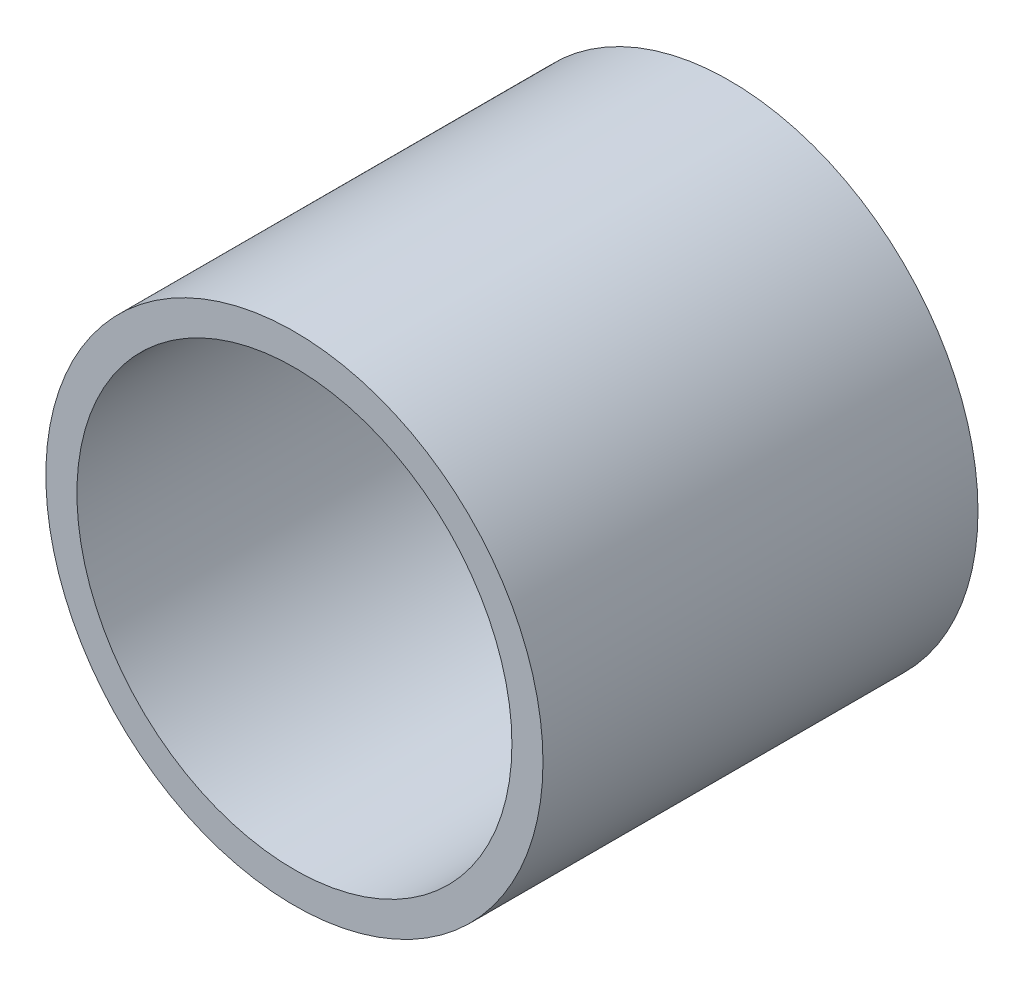
ISO-10303-21;
HEADER;
FILE_DESCRIPTION(('STEP AP214'),'2;1');
FILE_NAME('part.step','',(''),(''),'','','');
FILE_SCHEMA(('AUTOMOTIVE_DESIGN { 1 0 10303 214 1 1 1 1 }'));
ENDSEC;
DATA;
#1=APPLICATION_CONTEXT('core data for automotive mechanical design processes');
#2=APPLICATION_PROTOCOL_DEFINITION('international standard','automotive_design',2000,#1);
#3=PRODUCT_CONTEXT('',#1,'mechanical');
#4=PRODUCT('Part','Part','',(#3));
#5=PRODUCT_RELATED_PRODUCT_CATEGORY('part','',(#4));
#6=PRODUCT_DEFINITION_FORMATION('','',#4);
#7=PRODUCT_DEFINITION_CONTEXT('part definition',#1,'design');
#8=PRODUCT_DEFINITION('design','',#6,#7);
#9=PRODUCT_DEFINITION_SHAPE('','',#8);
#10=(LENGTH_UNIT() NAMED_UNIT(*) SI_UNIT(.MILLI.,.METRE.));
#11=(NAMED_UNIT(*) PLANE_ANGLE_UNIT() SI_UNIT($,.RADIAN.));
#12=(NAMED_UNIT(*) SI_UNIT($,.STERADIAN.) SOLID_ANGLE_UNIT());
#13=UNCERTAINTY_MEASURE_WITH_UNIT(LENGTH_MEASURE(1.E-05),#10,'distance_accuracy_value','');
#14=(GEOMETRIC_REPRESENTATION_CONTEXT(3) GLOBAL_UNCERTAINTY_ASSIGNED_CONTEXT((#13)) GLOBAL_UNIT_ASSIGNED_CONTEXT((#10,
#11,#12)) REPRESENTATION_CONTEXT('',''));
#15=CARTESIAN_POINT('',(0.,0.,0.));
#16=DIRECTION('',(0.,0.,1.));
#17=DIRECTION('',(1.,0.,0.));
#18=AXIS2_PLACEMENT_3D('',#15,#16,#17);
#19=CARTESIAN_POINT('',(0.,0.,11.1125));
#20=DIRECTION('',(0.,0.,1.));
#21=DIRECTION('',(1.,0.,0.));
#22=AXIS2_PLACEMENT_3D('',#19,#20,#21);
#23=PLANE('',#22);
#24=CARTESIAN_POINT('',(0.,0.,11.1125));
#25=DIRECTION('',(0.,0.,1.));
#26=DIRECTION('',(1.,0.,0.));
#27=AXIS2_PLACEMENT_3D('',#24,#25,#26);
#28=CIRCLE('',#27,6.35);
#29=CARTESIAN_POINT('',(6.35,0.,11.1125));
#30=VERTEX_POINT('',#29);
#31=EDGE_CURVE('E10',#30,#30,#28,.T.);
#32=ORIENTED_EDGE('',*,*,#31,.T.);
#33=EDGE_LOOP('',(#32));
#34=FACE_BOUND('',#33,.T.);
#35=CARTESIAN_POINT('',(0.,0.,11.1125));
#36=DIRECTION('',(0.,0.,1.));
#37=DIRECTION('',(1.,0.,0.));
#38=AXIS2_PLACEMENT_3D('',#35,#36,#37);
#39=CIRCLE('',#38,5.55625);
#40=CARTESIAN_POINT('',(5.55625,0.,11.1125));
#41=VERTEX_POINT('',#40);
#42=EDGE_CURVE('E43',#41,#41,#39,.T.);
#43=ORIENTED_EDGE('',*,*,#42,.F.);
#44=EDGE_LOOP('',(#43));
#45=FACE_BOUND('',#44,.T.);
#46=ADVANCED_FACE('F32',(#34,#45),#23,.T.);
#47=CARTESIAN_POINT('',(0.,0.,0.));
#48=DIRECTION('',(0.,0.,1.));
#49=DIRECTION('',(1.,0.,0.));
#50=AXIS2_PLACEMENT_3D('',#47,#48,#49);
#51=PLANE('',#50);
#52=CARTESIAN_POINT('',(0.,0.,0.));
#53=DIRECTION('',(0.,0.,1.));
#54=DIRECTION('',(1.,0.,0.));
#55=AXIS2_PLACEMENT_3D('',#52,#53,#54);
#56=CIRCLE('',#55,6.35);
#57=CARTESIAN_POINT('',(6.35,0.,0.));
#58=VERTEX_POINT('',#57);
#59=EDGE_CURVE('E36',#58,#58,#56,.T.);
#60=ORIENTED_EDGE('',*,*,#59,.F.);
#61=EDGE_LOOP('',(#60));
#62=FACE_BOUND('',#61,.T.);
#63=CARTESIAN_POINT('',(0.,0.,0.));
#64=DIRECTION('',(0.,0.,1.));
#65=DIRECTION('',(1.,0.,0.));
#66=AXIS2_PLACEMENT_3D('',#63,#64,#65);
#67=CIRCLE('',#66,5.55625);
#68=CARTESIAN_POINT('',(5.55625,0.,0.));
#69=VERTEX_POINT('',#68);
#70=EDGE_CURVE('E45',#69,#69,#67,.T.);
#71=ORIENTED_EDGE('',*,*,#70,.T.);
#72=EDGE_LOOP('',(#71));
#73=FACE_BOUND('',#72,.T.);
#74=ADVANCED_FACE('F55',(#62,#73),#51,.F.);
#75=CARTESIAN_POINT('',(0.,0.,11.1125));
#76=DIRECTION('',(0.,0.,-1.));
#77=DIRECTION('',(-1.,0.,0.));
#78=AXIS2_PLACEMENT_3D('',#75,#76,#77);
#79=CYLINDRICAL_SURFACE('',#78,6.35);
#80=ORIENTED_EDGE('',*,*,#31,.F.);
#81=EDGE_LOOP('',(#80));
#82=FACE_BOUND('',#81,.T.);
#83=ORIENTED_EDGE('',*,*,#59,.T.);
#84=EDGE_LOOP('',(#83));
#85=FACE_BOUND('',#84,.T.);
#86=ADVANCED_FACE('F34',(#82,#85),#79,.T.);
#87=CARTESIAN_POINT('',(0.,0.,11.1125));
#88=DIRECTION('',(0.,0.,-1.));
#89=DIRECTION('',(-1.,0.,0.));
#90=AXIS2_PLACEMENT_3D('',#87,#88,#89);
#91=CYLINDRICAL_SURFACE('',#90,5.55625);
#92=ORIENTED_EDGE('',*,*,#42,.T.);
#93=EDGE_LOOP('',(#92));
#94=FACE_BOUND('',#93,.T.);
#95=ORIENTED_EDGE('',*,*,#70,.F.);
#96=EDGE_LOOP('',(#95));
#97=FACE_BOUND('',#96,.T.);
#98=ADVANCED_FACE('F51',(#94,#97),#91,.F.);
#99=CLOSED_SHELL('',(#46,#74,#86,#98));
#100=MANIFOLD_SOLID_BREP('B2',#99);
#101=ADVANCED_BREP_SHAPE_REPRESENTATION('',(#18,#100),#14);
#102=SHAPE_DEFINITION_REPRESENTATION(#9,#101);
ENDSEC;
END-ISO-10303-21;
